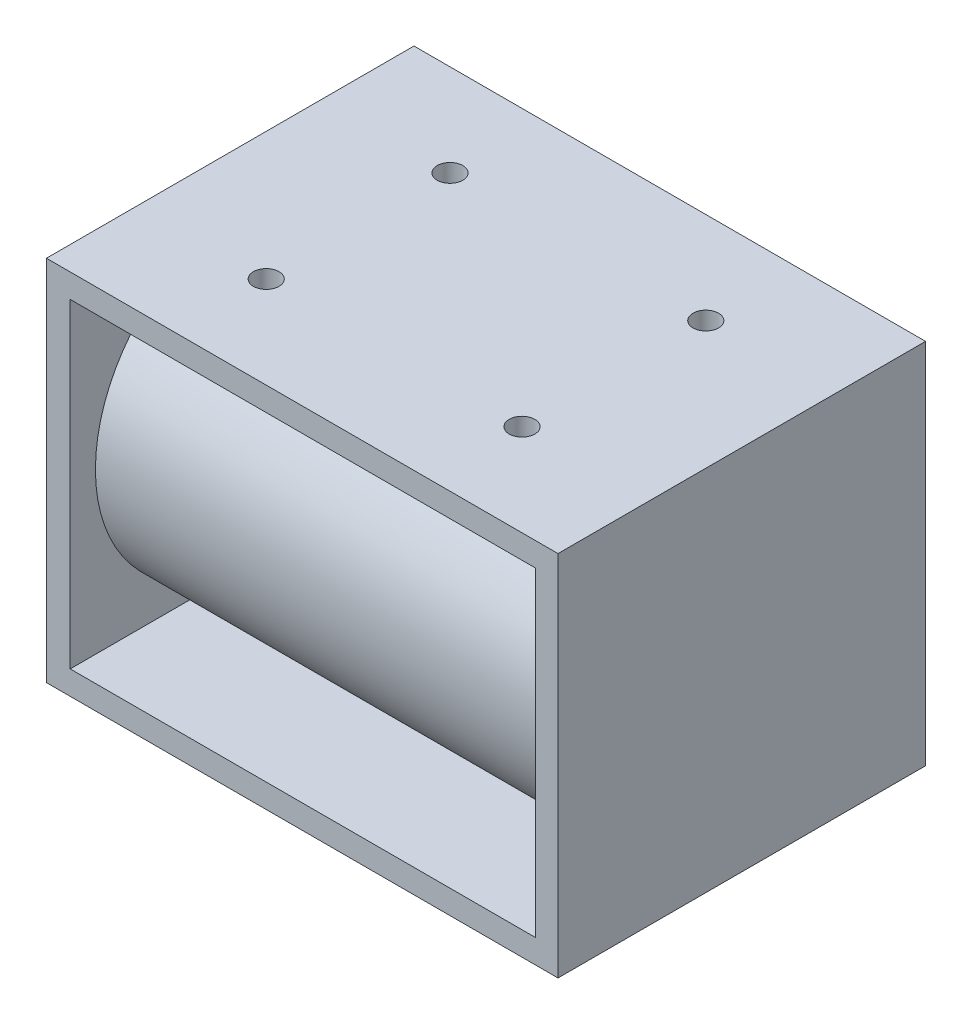
ISO-10303-21;
HEADER;
FILE_DESCRIPTION(('STEP AP214'),'2;1');
FILE_NAME('part.step','',(''),(''),'','','');
FILE_SCHEMA(('AUTOMOTIVE_DESIGN { 1 0 10303 214 1 1 1 1 }'));
ENDSEC;
DATA;
#1=APPLICATION_CONTEXT('core data for automotive mechanical design processes');
#2=APPLICATION_PROTOCOL_DEFINITION('international standard','automotive_design',2000,#1);
#3=PRODUCT_CONTEXT('',#1,'mechanical');
#4=PRODUCT('Part','Part','',(#3));
#5=PRODUCT_RELATED_PRODUCT_CATEGORY('part','',(#4));
#6=PRODUCT_DEFINITION_FORMATION('','',#4);
#7=PRODUCT_DEFINITION_CONTEXT('part definition',#1,'design');
#8=PRODUCT_DEFINITION('design','',#6,#7);
#9=PRODUCT_DEFINITION_SHAPE('','',#8);
#10=(LENGTH_UNIT() NAMED_UNIT(*) SI_UNIT(.MILLI.,.METRE.));
#11=(NAMED_UNIT(*) PLANE_ANGLE_UNIT() SI_UNIT($,.RADIAN.));
#12=(NAMED_UNIT(*) SI_UNIT($,.STERADIAN.) SOLID_ANGLE_UNIT());
#13=UNCERTAINTY_MEASURE_WITH_UNIT(LENGTH_MEASURE(1.E-05),#10,'distance_accuracy_value','');
#14=(GEOMETRIC_REPRESENTATION_CONTEXT(3) GLOBAL_UNCERTAINTY_ASSIGNED_CONTEXT((#13)) GLOBAL_UNIT_ASSIGNED_CONTEXT((#10,
#11,#12)) REPRESENTATION_CONTEXT('',''));
#15=CARTESIAN_POINT('',(0.,0.,0.));
#16=DIRECTION('',(0.,0.,1.));
#17=DIRECTION('',(1.,0.,0.));
#18=AXIS2_PLACEMENT_3D('',#15,#16,#17);
#19=CARTESIAN_POINT('',(2.3622,2.3622,36.4998));
#20=DIRECTION('',(1.,0.,0.));
#21=DIRECTION('',(0.,0.,-1.));
#22=AXIS2_PLACEMENT_3D('',#19,#20,#21);
#23=PLANE('',#22);
#24=DIRECTION('',(0.,-1.,0.));
#25=VECTOR('',#24,1.);
#26=CARTESIAN_POINT('',(2.3622,2.3622,0.));
#27=LINE('',#26,#25);
#28=CARTESIAN_POINT('',(2.3622,34.1376,0.));
#29=VERTEX_POINT('',#28);
#30=CARTESIAN_POINT('',(2.3622,2.3622,0.));
#31=VERTEX_POINT('',#30);
#32=EDGE_CURVE('E56',#29,#31,#27,.T.);
#33=ORIENTED_EDGE('',*,*,#32,.F.);
#34=DIRECTION('',(0.,0.,-1.));
#35=VECTOR('',#34,1.);
#36=CARTESIAN_POINT('',(2.3622,34.1376,36.4998));
#37=LINE('',#36,#35);
#38=CARTESIAN_POINT('',(2.3622,34.1376,36.4998));
#39=VERTEX_POINT('',#38);
#40=EDGE_CURVE('E102',#39,#29,#37,.T.);
#41=ORIENTED_EDGE('',*,*,#40,.F.);
#42=DIRECTION('',(0.,-1.,0.));
#43=VECTOR('',#42,1.);
#44=CARTESIAN_POINT('',(2.3622,2.3622,36.4998));
#45=LINE('',#44,#43);
#46=CARTESIAN_POINT('',(2.3622,2.3622,36.4998));
#47=VERTEX_POINT('',#46);
#48=EDGE_CURVE('E98',#39,#47,#45,.T.);
#49=ORIENTED_EDGE('',*,*,#48,.T.);
#50=DIRECTION('',(0.,0.,-1.));
#51=VECTOR('',#50,1.);
#52=CARTESIAN_POINT('',(2.3622,2.3622,36.4998));
#53=LINE('',#52,#51);
#54=EDGE_CURVE('E101',#47,#31,#53,.T.);
#55=ORIENTED_EDGE('',*,*,#54,.T.);
#56=EDGE_LOOP('',(#33,#41,#49,#55));
#57=FACE_BOUND('',#56,.T.);
#58=CARTESIAN_POINT('',(2.3622,18.2499,18.2499));
#59=DIRECTION('',(1.,0.,0.));
#60=DIRECTION('',(0.,0.,-1.));
#61=AXIS2_PLACEMENT_3D('',#58,#59,#60);
#62=CIRCLE('',#61,15.748);
#63=CARTESIAN_POINT('',(2.3622,18.2499,2.5019));
#64=VERTEX_POINT('',#63);
#65=EDGE_CURVE('E234',#64,#64,#62,.T.);
#66=ORIENTED_EDGE('',*,*,#65,.F.);
#67=EDGE_LOOP('',(#66));
#68=FACE_BOUND('',#67,.T.);
#69=ADVANCED_FACE('F33',(#57,#68),#23,.T.);
#70=CARTESIAN_POINT('',(0.,0.,36.4998));
#71=DIRECTION('',(0.,0.,-1.));
#72=DIRECTION('',(-1.,0.,0.));
#73=AXIS2_PLACEMENT_3D('',#70,#71,#72);
#74=PLANE('',#73);
#75=DIRECTION('',(0.,-1.,0.));
#76=VECTOR('',#75,1.);
#77=CARTESIAN_POINT('',(0.,0.,36.4998));
#78=LINE('',#77,#76);
#79=CARTESIAN_POINT('',(0.,36.4998,36.4998));
#80=VERTEX_POINT('',#79);
#81=CARTESIAN_POINT('',(0.,0.,36.4998));
#82=VERTEX_POINT('',#81);
#83=EDGE_CURVE('E137',#80,#82,#78,.T.);
#84=ORIENTED_EDGE('',*,*,#83,.T.);
#85=DIRECTION('',(1.,0.,0.));
#86=VECTOR('',#85,1.);
#87=CARTESIAN_POINT('',(0.,0.,36.4998));
#88=LINE('',#87,#86);
#89=CARTESIAN_POINT('',(50.8,0.,36.4998));
#90=VERTEX_POINT('',#89);
#91=EDGE_CURVE('E140',#82,#90,#88,.T.);
#92=ORIENTED_EDGE('',*,*,#91,.T.);
#93=DIRECTION('',(0.,1.,0.));
#94=VECTOR('',#93,1.);
#95=CARTESIAN_POINT('',(50.8,0.,36.4998));
#96=LINE('',#95,#94);
#97=CARTESIAN_POINT('',(50.8,36.4998,36.4998));
#98=VERTEX_POINT('',#97);
#99=EDGE_CURVE('E143',#90,#98,#96,.T.);
#100=ORIENTED_EDGE('',*,*,#99,.T.);
#101=DIRECTION('',(-1.,0.,0.));
#102=VECTOR('',#101,1.);
#103=CARTESIAN_POINT('',(0.,36.4998,36.4998));
#104=LINE('',#103,#102);
#105=EDGE_CURVE('E145',#98,#80,#104,.T.);
#106=ORIENTED_EDGE('',*,*,#105,.T.);
#107=EDGE_LOOP('',(#84,#92,#100,#106));
#108=FACE_BOUND('',#107,.T.);
#109=ORIENTED_EDGE('',*,*,#48,.F.);
#110=DIRECTION('',(-1.,0.,0.));
#111=VECTOR('',#110,1.);
#112=CARTESIAN_POINT('',(2.3622,34.1376,36.4998));
#113=LINE('',#112,#111);
#114=CARTESIAN_POINT('',(48.5654627741638,34.1376,36.4998));
#115=VERTEX_POINT('',#114);
#116=EDGE_CURVE('E121',#115,#39,#113,.T.);
#117=ORIENTED_EDGE('',*,*,#116,.F.);
#118=DIRECTION('',(0.,1.,0.));
#119=VECTOR('',#118,1.);
#120=CARTESIAN_POINT('',(48.5654627741638,2.3622,36.4998));
#121=LINE('',#120,#119);
#122=CARTESIAN_POINT('',(48.5654627741638,2.3622,36.4998));
#123=VERTEX_POINT('',#122);
#124=EDGE_CURVE('E119',#123,#115,#121,.T.);
#125=ORIENTED_EDGE('',*,*,#124,.F.);
#126=DIRECTION('',(1.,0.,0.));
#127=VECTOR('',#126,1.);
#128=CARTESIAN_POINT('',(2.3622,2.3622,36.4998));
#129=LINE('',#128,#127);
#130=EDGE_CURVE('E106',#47,#123,#129,.T.);
#131=ORIENTED_EDGE('',*,*,#130,.F.);
#132=EDGE_LOOP('',(#109,#117,#125,#131));
#133=FACE_BOUND('',#132,.T.);
#134=ADVANCED_FACE('F118',(#108,#133),#74,.F.);
#135=CARTESIAN_POINT('',(0.,0.,0.));
#136=DIRECTION('',(0.,0.,-1.));
#137=DIRECTION('',(-1.,0.,0.));
#138=AXIS2_PLACEMENT_3D('',#135,#136,#137);
#139=PLANE('',#138);
#140=DIRECTION('',(0.,-1.,0.));
#141=VECTOR('',#140,1.);
#142=CARTESIAN_POINT('',(0.,0.,0.));
#143=LINE('',#142,#141);
#144=CARTESIAN_POINT('',(0.,36.4998,0.));
#145=VERTEX_POINT('',#144);
#146=CARTESIAN_POINT('',(0.,0.,0.));
#147=VERTEX_POINT('',#146);
#148=EDGE_CURVE('E114',#145,#147,#143,.T.);
#149=ORIENTED_EDGE('',*,*,#148,.F.);
#150=DIRECTION('',(-1.,0.,0.));
#151=VECTOR('',#150,1.);
#152=CARTESIAN_POINT('',(0.,36.4998,0.));
#153=LINE('',#152,#151);
#154=CARTESIAN_POINT('',(50.8,36.4998,0.));
#155=VERTEX_POINT('',#154);
#156=EDGE_CURVE('E141',#155,#145,#153,.T.);
#157=ORIENTED_EDGE('',*,*,#156,.F.);
#158=DIRECTION('',(0.,1.,0.));
#159=VECTOR('',#158,1.);
#160=CARTESIAN_POINT('',(50.8,0.,0.));
#161=LINE('',#160,#159);
#162=CARTESIAN_POINT('',(50.8,0.,0.));
#163=VERTEX_POINT('',#162);
#164=EDGE_CURVE('E152',#163,#155,#161,.T.);
#165=ORIENTED_EDGE('',*,*,#164,.F.);
#166=DIRECTION('',(1.,0.,0.));
#167=VECTOR('',#166,1.);
#168=CARTESIAN_POINT('',(0.,0.,0.));
#169=LINE('',#168,#167);
#170=EDGE_CURVE('E150',#147,#163,#169,.T.);
#171=ORIENTED_EDGE('',*,*,#170,.F.);
#172=EDGE_LOOP('',(#149,#157,#165,#171));
#173=FACE_BOUND('',#172,.T.);
#174=DIRECTION('',(-1.,0.,0.));
#175=VECTOR('',#174,1.);
#176=CARTESIAN_POINT('',(2.3622,34.1376,0.));
#177=LINE('',#176,#175);
#178=CARTESIAN_POINT('',(48.5654627741638,34.1376,0.));
#179=VERTEX_POINT('',#178);
#180=EDGE_CURVE('E107',#179,#29,#177,.T.);
#181=ORIENTED_EDGE('',*,*,#180,.T.);
#182=ORIENTED_EDGE('',*,*,#32,.T.);
#183=DIRECTION('',(1.,0.,0.));
#184=VECTOR('',#183,1.);
#185=CARTESIAN_POINT('',(2.3622,2.3622,0.));
#186=LINE('',#185,#184);
#187=CARTESIAN_POINT('',(48.5654627741638,2.3622,0.));
#188=VERTEX_POINT('',#187);
#189=EDGE_CURVE('E113',#31,#188,#186,.T.);
#190=ORIENTED_EDGE('',*,*,#189,.T.);
#191=DIRECTION('',(0.,1.,0.));
#192=VECTOR('',#191,1.);
#193=CARTESIAN_POINT('',(48.5654627741638,2.3622,0.));
#194=LINE('',#193,#192);
#195=EDGE_CURVE('E129',#188,#179,#194,.T.);
#196=ORIENTED_EDGE('',*,*,#195,.T.);
#197=EDGE_LOOP('',(#181,#182,#190,#196));
#198=FACE_BOUND('',#197,.T.);
#199=ADVANCED_FACE('F170',(#173,#198),#139,.T.);
#200=CARTESIAN_POINT('',(0.,0.,36.4998));
#201=DIRECTION('',(1.,0.,0.));
#202=DIRECTION('',(0.,0.,-1.));
#203=AXIS2_PLACEMENT_3D('',#200,#201,#202);
#204=PLANE('',#203);
#205=CARTESIAN_POINT('',(0.,18.2499,18.2499));
#206=DIRECTION('',(-1.,0.,0.));
#207=DIRECTION('',(0.,0.,1.));
#208=AXIS2_PLACEMENT_3D('',#205,#206,#207);
#209=CIRCLE('',#208,5.5499);
#210=CARTESIAN_POINT('',(0.,18.2499,23.7998));
#211=VERTEX_POINT('',#210);
#212=EDGE_CURVE('E221',#211,#211,#209,.T.);
#213=ORIENTED_EDGE('',*,*,#212,.F.);
#214=EDGE_LOOP('',(#213));
#215=FACE_BOUND('',#214,.T.);
#216=ORIENTED_EDGE('',*,*,#148,.T.);
#217=DIRECTION('',(0.,0.,-1.));
#218=VECTOR('',#217,1.);
#219=CARTESIAN_POINT('',(0.,0.,36.4998));
#220=LINE('',#219,#218);
#221=EDGE_CURVE('E11',#82,#147,#220,.T.);
#222=ORIENTED_EDGE('',*,*,#221,.F.);
#223=ORIENTED_EDGE('',*,*,#83,.F.);
#224=DIRECTION('',(0.,0.,-1.));
#225=VECTOR('',#224,1.);
#226=CARTESIAN_POINT('',(0.,36.4998,36.4998));
#227=LINE('',#226,#225);
#228=EDGE_CURVE('E147',#80,#145,#227,.T.);
#229=ORIENTED_EDGE('',*,*,#228,.T.);
#230=EDGE_LOOP('',(#216,#222,#223,#229));
#231=FACE_BOUND('',#230,.T.);
#232=ADVANCED_FACE('F35',(#215,#231),#204,.F.);
#233=CARTESIAN_POINT('',(0.,0.,36.4998));
#234=DIRECTION('',(0.,1.,0.));
#235=DIRECTION('',(0.,0.,1.));
#236=AXIS2_PLACEMENT_3D('',#233,#234,#235);
#237=PLANE('',#236);
#238=ORIENTED_EDGE('',*,*,#170,.T.);
#239=DIRECTION('',(0.,0.,-1.));
#240=VECTOR('',#239,1.);
#241=CARTESIAN_POINT('',(50.8,0.,36.4998));
#242=LINE('',#241,#240);
#243=EDGE_CURVE('E41',#90,#163,#242,.T.);
#244=ORIENTED_EDGE('',*,*,#243,.F.);
#245=ORIENTED_EDGE('',*,*,#91,.F.);
#246=ORIENTED_EDGE('',*,*,#221,.T.);
#247=EDGE_LOOP('',(#238,#244,#245,#246));
#248=FACE_BOUND('',#247,.T.);
#249=ADVANCED_FACE('F180',(#248),#237,.F.);
#250=CARTESIAN_POINT('',(50.8,0.,36.4998));
#251=DIRECTION('',(-1.,0.,0.));
#252=DIRECTION('',(0.,0.,1.));
#253=AXIS2_PLACEMENT_3D('',#250,#251,#252);
#254=PLANE('',#253);
#255=ORIENTED_EDGE('',*,*,#164,.T.);
#256=DIRECTION('',(0.,0.,-1.));
#257=VECTOR('',#256,1.);
#258=CARTESIAN_POINT('',(50.8,36.4998,36.4998));
#259=LINE('',#258,#257);
#260=EDGE_CURVE('E157',#98,#155,#259,.T.);
#261=ORIENTED_EDGE('',*,*,#260,.F.);
#262=ORIENTED_EDGE('',*,*,#99,.F.);
#263=ORIENTED_EDGE('',*,*,#243,.T.);
#264=EDGE_LOOP('',(#255,#261,#262,#263));
#265=FACE_BOUND('',#264,.T.);
#266=ADVANCED_FACE('F164',(#265),#254,.F.);
#267=CARTESIAN_POINT('',(0.,36.4998,36.4998));
#268=DIRECTION('',(0.,-1.,0.));
#269=DIRECTION('',(0.,0.,-1.));
#270=AXIS2_PLACEMENT_3D('',#267,#268,#269);
#271=PLANE('',#270);
#272=CARTESIAN_POINT('',(12.7,36.4998,27.37485));
#273=DIRECTION('',(0.,1.,0.));
#274=DIRECTION('',(0.,0.,1.));
#275=AXIS2_PLACEMENT_3D('',#272,#273,#274);
#276=CIRCLE('',#275,1.27);
#277=CARTESIAN_POINT('',(12.7,36.4998,28.64485));
#278=VERTEX_POINT('',#277);
#279=EDGE_CURVE('E208',#278,#278,#276,.T.);
#280=ORIENTED_EDGE('',*,*,#279,.F.);
#281=EDGE_LOOP('',(#280));
#282=FACE_BOUND('',#281,.T.);
#283=CARTESIAN_POINT('',(38.1,36.4998,27.37485));
#284=DIRECTION('',(0.,1.,0.));
#285=DIRECTION('',(0.,0.,-1.));
#286=AXIS2_PLACEMENT_3D('',#283,#284,#285);
#287=CIRCLE('',#286,1.27);
#288=CARTESIAN_POINT('',(38.1,36.4998,26.10485));
#289=VERTEX_POINT('',#288);
#290=EDGE_CURVE('E212',#289,#289,#287,.T.);
#291=ORIENTED_EDGE('',*,*,#290,.F.);
#292=EDGE_LOOP('',(#291));
#293=FACE_BOUND('',#292,.T.);
#294=CARTESIAN_POINT('',(12.7,36.4998,9.12495));
#295=DIRECTION('',(0.,1.,0.));
#296=DIRECTION('',(0.,0.,-1.));
#297=AXIS2_PLACEMENT_3D('',#294,#295,#296);
#298=CIRCLE('',#297,1.27);
#299=CARTESIAN_POINT('',(12.7,36.4998,7.85495));
#300=VERTEX_POINT('',#299);
#301=EDGE_CURVE('E216',#300,#300,#298,.T.);
#302=ORIENTED_EDGE('',*,*,#301,.F.);
#303=EDGE_LOOP('',(#302));
#304=FACE_BOUND('',#303,.T.);
#305=CARTESIAN_POINT('',(38.1,36.4998,9.12495));
#306=DIRECTION('',(0.,1.,0.));
#307=DIRECTION('',(0.,0.,1.));
#308=AXIS2_PLACEMENT_3D('',#305,#306,#307);
#309=CIRCLE('',#308,1.27);
#310=CARTESIAN_POINT('',(38.1,36.4998,10.39495));
#311=VERTEX_POINT('',#310);
#312=EDGE_CURVE('E219',#311,#311,#309,.T.);
#313=ORIENTED_EDGE('',*,*,#312,.F.);
#314=EDGE_LOOP('',(#313));
#315=FACE_BOUND('',#314,.T.);
#316=ORIENTED_EDGE('',*,*,#156,.T.);
#317=ORIENTED_EDGE('',*,*,#228,.F.);
#318=ORIENTED_EDGE('',*,*,#105,.F.);
#319=ORIENTED_EDGE('',*,*,#260,.T.);
#320=EDGE_LOOP('',(#316,#317,#318,#319));
#321=FACE_BOUND('',#320,.T.);
#322=ADVANCED_FACE('F174',(#282,#293,#304,#315,#321),#271,.F.);
#323=CARTESIAN_POINT('',(2.3622,2.3622,36.4998));
#324=DIRECTION('',(0.,1.,0.));
#325=DIRECTION('',(0.,0.,1.));
#326=AXIS2_PLACEMENT_3D('',#323,#324,#325);
#327=PLANE('',#326);
#328=ORIENTED_EDGE('',*,*,#189,.F.);
#329=ORIENTED_EDGE('',*,*,#54,.F.);
#330=ORIENTED_EDGE('',*,*,#130,.T.);
#331=DIRECTION('',(0.,0.,-1.));
#332=VECTOR('',#331,1.);
#333=CARTESIAN_POINT('',(48.5654627741638,2.3622,36.4998));
#334=LINE('',#333,#332);
#335=EDGE_CURVE('E115',#123,#188,#334,.T.);
#336=ORIENTED_EDGE('',*,*,#335,.T.);
#337=EDGE_LOOP('',(#328,#329,#330,#336));
#338=FACE_BOUND('',#337,.T.);
#339=ADVANCED_FACE('F110',(#338),#327,.T.);
#340=CARTESIAN_POINT('',(48.5654627741638,2.3622,36.4998));
#341=DIRECTION('',(-1.,0.,0.));
#342=DIRECTION('',(0.,0.,1.));
#343=AXIS2_PLACEMENT_3D('',#340,#341,#342);
#344=PLANE('',#343);
#345=ORIENTED_EDGE('',*,*,#195,.F.);
#346=ORIENTED_EDGE('',*,*,#335,.F.);
#347=ORIENTED_EDGE('',*,*,#124,.T.);
#348=DIRECTION('',(0.,0.,-1.));
#349=VECTOR('',#348,1.);
#350=CARTESIAN_POINT('',(48.5654627741638,34.1376,36.4998));
#351=LINE('',#350,#349);
#352=EDGE_CURVE('E48',#115,#179,#351,.T.);
#353=ORIENTED_EDGE('',*,*,#352,.T.);
#354=EDGE_LOOP('',(#345,#346,#347,#353));
#355=FACE_BOUND('',#354,.T.);
#356=ADVANCED_FACE('F204',(#355),#344,.T.);
#357=CARTESIAN_POINT('',(2.3622,34.1376,36.4998));
#358=DIRECTION('',(0.,-1.,0.));
#359=DIRECTION('',(0.,0.,-1.));
#360=AXIS2_PLACEMENT_3D('',#357,#358,#359);
#361=PLANE('',#360);
#362=CARTESIAN_POINT('',(12.7,34.1376,27.37485));
#363=DIRECTION('',(0.,-1.,0.));
#364=DIRECTION('',(0.,0.,-1.));
#365=AXIS2_PLACEMENT_3D('',#362,#363,#364);
#366=CIRCLE('',#365,1.27);
#367=CARTESIAN_POINT('',(12.7,34.1376,26.10485));
#368=VERTEX_POINT('',#367);
#369=EDGE_CURVE('E388',#368,#368,#366,.F.);
#370=ORIENTED_EDGE('',*,*,#369,.T.);
#371=EDGE_LOOP('',(#370));
#372=FACE_BOUND('',#371,.T.);
#373=CARTESIAN_POINT('',(38.1,34.1376,27.37485));
#374=DIRECTION('',(0.,-1.,0.));
#375=DIRECTION('',(0.,0.,-1.));
#376=AXIS2_PLACEMENT_3D('',#373,#374,#375);
#377=CIRCLE('',#376,1.27);
#378=CARTESIAN_POINT('',(38.1,34.1376,26.10485));
#379=VERTEX_POINT('',#378);
#380=EDGE_CURVE('E389',#379,#379,#377,.F.);
#381=ORIENTED_EDGE('',*,*,#380,.T.);
#382=EDGE_LOOP('',(#381));
#383=FACE_BOUND('',#382,.T.);
#384=CARTESIAN_POINT('',(12.7,34.1376,9.12495));
#385=DIRECTION('',(0.,-1.,0.));
#386=DIRECTION('',(0.,0.,-1.));
#387=AXIS2_PLACEMENT_3D('',#384,#385,#386);
#388=CIRCLE('',#387,1.27);
#389=CARTESIAN_POINT('',(12.7,34.1376,7.85495));
#390=VERTEX_POINT('',#389);
#391=EDGE_CURVE('E230',#390,#390,#388,.F.);
#392=ORIENTED_EDGE('',*,*,#391,.T.);
#393=EDGE_LOOP('',(#392));
#394=FACE_BOUND('',#393,.T.);
#395=CARTESIAN_POINT('',(38.1,34.1376,9.12495));
#396=DIRECTION('',(0.,-1.,0.));
#397=DIRECTION('',(0.,0.,-1.));
#398=AXIS2_PLACEMENT_3D('',#395,#396,#397);
#399=CIRCLE('',#398,1.27);
#400=CARTESIAN_POINT('',(38.1,34.1376,7.85495));
#401=VERTEX_POINT('',#400);
#402=EDGE_CURVE('E222',#401,#401,#399,.F.);
#403=ORIENTED_EDGE('',*,*,#402,.T.);
#404=EDGE_LOOP('',(#403));
#405=FACE_BOUND('',#404,.T.);
#406=ORIENTED_EDGE('',*,*,#180,.F.);
#407=ORIENTED_EDGE('',*,*,#352,.F.);
#408=ORIENTED_EDGE('',*,*,#116,.T.);
#409=ORIENTED_EDGE('',*,*,#40,.T.);
#410=EDGE_LOOP('',(#406,#407,#408,#409));
#411=FACE_BOUND('',#410,.T.);
#412=ADVANCED_FACE('F243',(#372,#383,#394,#405,#411),#361,.T.);
#413=CARTESIAN_POINT('',(48.4378,18.2499,18.2499));
#414=DIRECTION('',(-1.,0.,0.));
#415=DIRECTION('',(0.,0.,1.));
#416=AXIS2_PLACEMENT_3D('',#413,#414,#415);
#417=CYLINDRICAL_SURFACE('',#416,15.748);
#418=CARTESIAN_POINT('',(48.4378,18.2499,18.2499));
#419=DIRECTION('',(1.,0.,0.));
#420=DIRECTION('',(0.,0.,-1.));
#421=AXIS2_PLACEMENT_3D('',#418,#419,#420);
#422=CIRCLE('',#421,15.748);
#423=CARTESIAN_POINT('',(48.4378,18.2499,2.5019));
#424=VERTEX_POINT('',#423);
#425=EDGE_CURVE('E127',#424,#424,#422,.T.);
#426=ORIENTED_EDGE('',*,*,#425,.F.);
#427=EDGE_LOOP('',(#426));
#428=FACE_BOUND('',#427,.T.);
#429=ORIENTED_EDGE('',*,*,#65,.T.);
#430=EDGE_LOOP('',(#429));
#431=FACE_BOUND('',#430,.T.);
#432=ADVANCED_FACE('F240',(#428,#431),#417,.T.);
#433=CARTESIAN_POINT('',(48.4378,18.2499,18.2499));
#434=DIRECTION('',(1.,0.,0.));
#435=DIRECTION('',(0.,0.,-1.));
#436=AXIS2_PLACEMENT_3D('',#433,#434,#435);
#437=PLANE('',#436);
#438=ORIENTED_EDGE('',*,*,#425,.T.);
#439=EDGE_LOOP('',(#438));
#440=FACE_BOUND('',#439,.T.);
#441=ADVANCED_FACE('F242',(#440),#437,.T.);
#442=CARTESIAN_POINT('',(25.4,18.2499,18.2499));
#443=DIRECTION('',(-1.,0.,0.));
#444=DIRECTION('',(0.,0.,1.));
#445=AXIS2_PLACEMENT_3D('',#442,#443,#444);
#446=CYLINDRICAL_SURFACE('',#445,5.5499);
#447=CARTESIAN_POINT('',(25.4,18.2499,18.2499));
#448=DIRECTION('',(-1.,0.,0.));
#449=DIRECTION('',(0.,0.,1.));
#450=AXIS2_PLACEMENT_3D('',#447,#448,#449);
#451=CIRCLE('',#450,5.5499);
#452=CARTESIAN_POINT('',(25.4,18.2499,23.7998));
#453=VERTEX_POINT('',#452);
#454=EDGE_CURVE('E225',#453,#453,#451,.T.);
#455=ORIENTED_EDGE('',*,*,#454,.F.);
#456=EDGE_LOOP('',(#455));
#457=FACE_BOUND('',#456,.T.);
#458=ORIENTED_EDGE('',*,*,#212,.T.);
#459=EDGE_LOOP('',(#458));
#460=FACE_BOUND('',#459,.T.);
#461=ADVANCED_FACE('F250',(#457,#460),#446,.F.);
#462=CARTESIAN_POINT('',(25.4,18.2499,18.2499));
#463=DIRECTION('',(-1.,0.,0.));
#464=DIRECTION('',(0.,0.,1.));
#465=AXIS2_PLACEMENT_3D('',#462,#463,#464);
#466=PLANE('',#465);
#467=ORIENTED_EDGE('',*,*,#454,.T.);
#468=EDGE_LOOP('',(#467));
#469=FACE_BOUND('',#468,.T.);
#470=ADVANCED_FACE('F283',(#469),#466,.T.);
#471=CARTESIAN_POINT('',(38.1,-0.001000000000001,9.12495));
#472=DIRECTION('',(0.,1.,0.));
#473=DIRECTION('',(0.,0.,1.));
#474=AXIS2_PLACEMENT_3D('',#471,#472,#473);
#475=CYLINDRICAL_SURFACE('',#474,1.27);
#476=ORIENTED_EDGE('',*,*,#402,.F.);
#477=EDGE_LOOP('',(#476));
#478=FACE_BOUND('',#477,.T.);
#479=ORIENTED_EDGE('',*,*,#312,.T.);
#480=EDGE_LOOP('',(#479));
#481=FACE_BOUND('',#480,.T.);
#482=ADVANCED_FACE('F277',(#478,#481),#475,.F.);
#483=CARTESIAN_POINT('',(12.7,-0.001000000000001,9.12495));
#484=DIRECTION('',(0.,1.,0.));
#485=DIRECTION('',(0.,0.,1.));
#486=AXIS2_PLACEMENT_3D('',#483,#484,#485);
#487=CYLINDRICAL_SURFACE('',#486,1.27);
#488=ORIENTED_EDGE('',*,*,#391,.F.);
#489=EDGE_LOOP('',(#488));
#490=FACE_BOUND('',#489,.T.);
#491=ORIENTED_EDGE('',*,*,#301,.T.);
#492=EDGE_LOOP('',(#491));
#493=FACE_BOUND('',#492,.T.);
#494=ADVANCED_FACE('F282',(#490,#493),#487,.F.);
#495=CARTESIAN_POINT('',(38.1,-0.001000000000001,27.37485));
#496=DIRECTION('',(0.,1.,0.));
#497=DIRECTION('',(0.,0.,1.));
#498=AXIS2_PLACEMENT_3D('',#495,#496,#497);
#499=CYLINDRICAL_SURFACE('',#498,1.27);
#500=ORIENTED_EDGE('',*,*,#380,.F.);
#501=EDGE_LOOP('',(#500));
#502=FACE_BOUND('',#501,.T.);
#503=ORIENTED_EDGE('',*,*,#290,.T.);
#504=EDGE_LOOP('',(#503));
#505=FACE_BOUND('',#504,.T.);
#506=ADVANCED_FACE('F295',(#502,#505),#499,.F.);
#507=CARTESIAN_POINT('',(12.7,-0.001000000000001,27.37485));
#508=DIRECTION('',(0.,1.,0.));
#509=DIRECTION('',(0.,0.,1.));
#510=AXIS2_PLACEMENT_3D('',#507,#508,#509);
#511=CYLINDRICAL_SURFACE('',#510,1.27);
#512=ORIENTED_EDGE('',*,*,#369,.F.);
#513=EDGE_LOOP('',(#512));
#514=FACE_BOUND('',#513,.T.);
#515=ORIENTED_EDGE('',*,*,#279,.T.);
#516=EDGE_LOOP('',(#515));
#517=FACE_BOUND('',#516,.T.);
#518=ADVANCED_FACE('F305',(#514,#517),#511,.F.);
#519=CLOSED_SHELL('',(#69,#134,#199,#232,#249,#266,#322,#339,#356,#412,#432,#441,#461,#470,#482,
#494,#506,#518));
#520=MANIFOLD_SOLID_BREP('B2',#519);
#521=ADVANCED_BREP_SHAPE_REPRESENTATION('',(#18,#520),#14);
#522=SHAPE_DEFINITION_REPRESENTATION(#9,#521);
ENDSEC;
END-ISO-10303-21;
